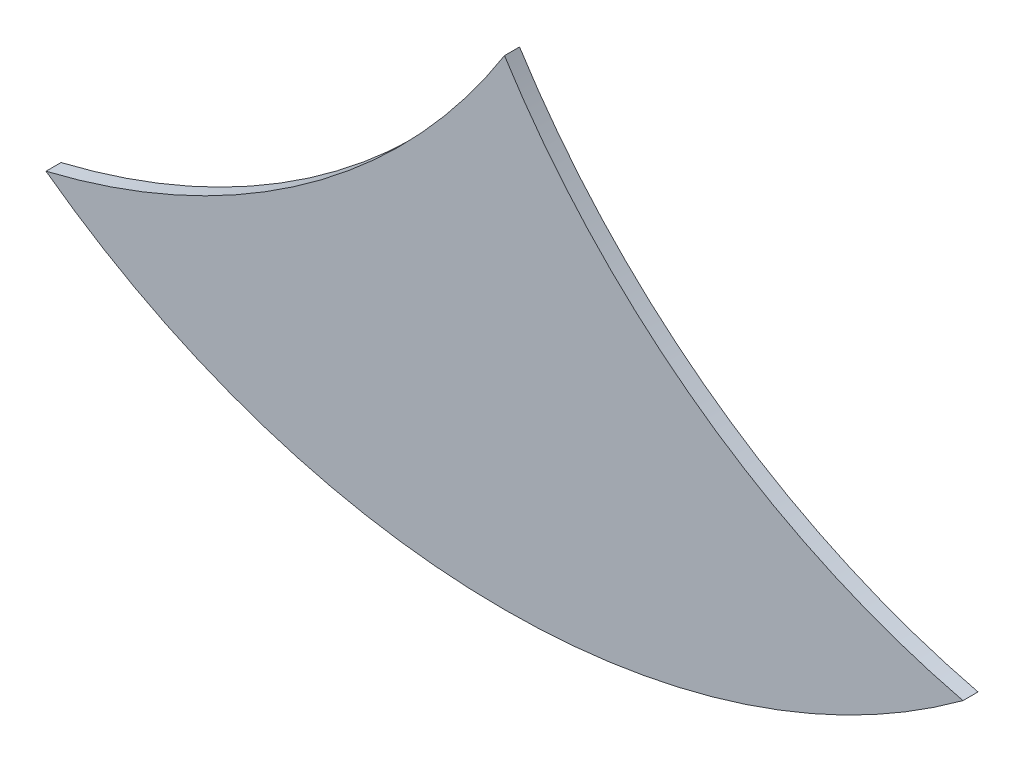
ISO-10303-21;
HEADER;
FILE_DESCRIPTION(('STEP AP214'),'2;1');
FILE_NAME('part.step','',(''),(''),'','','');
FILE_SCHEMA(('AUTOMOTIVE_DESIGN { 1 0 10303 214 1 1 1 1 }'));
ENDSEC;
DATA;
#1=APPLICATION_CONTEXT('core data for automotive mechanical design processes');
#2=APPLICATION_PROTOCOL_DEFINITION('international standard','automotive_design',2000,#1);
#3=PRODUCT_CONTEXT('',#1,'mechanical');
#4=PRODUCT('Part','Part','',(#3));
#5=PRODUCT_RELATED_PRODUCT_CATEGORY('part','',(#4));
#6=PRODUCT_DEFINITION_FORMATION('','',#4);
#7=PRODUCT_DEFINITION_CONTEXT('part definition',#1,'design');
#8=PRODUCT_DEFINITION('design','',#6,#7);
#9=PRODUCT_DEFINITION_SHAPE('','',#8);
#10=(LENGTH_UNIT() NAMED_UNIT(*) SI_UNIT(.MILLI.,.METRE.));
#11=(NAMED_UNIT(*) PLANE_ANGLE_UNIT() SI_UNIT($,.RADIAN.));
#12=(NAMED_UNIT(*) SI_UNIT($,.STERADIAN.) SOLID_ANGLE_UNIT());
#13=UNCERTAINTY_MEASURE_WITH_UNIT(LENGTH_MEASURE(1.E-05),#10,'distance_accuracy_value','');
#14=(GEOMETRIC_REPRESENTATION_CONTEXT(3) GLOBAL_UNCERTAINTY_ASSIGNED_CONTEXT((#13)) GLOBAL_UNIT_ASSIGNED_CONTEXT((#10,
#11,#12)) REPRESENTATION_CONTEXT('',''));
#15=CARTESIAN_POINT('',(0.,0.,0.));
#16=DIRECTION('',(0.,0.,1.));
#17=DIRECTION('',(1.,0.,0.));
#18=AXIS2_PLACEMENT_3D('',#15,#16,#17);
#19=CARTESIAN_POINT('',(30.351870026325,22.9673161893469,0.1));
#20=DIRECTION('',(0.,0.,-1.));
#21=DIRECTION('',(-1.,0.,0.));
#22=AXIS2_PLACEMENT_3D('',#19,#20,#21);
#23=CYLINDRICAL_SURFACE('',#22,4.99437516975804);
#24=CARTESIAN_POINT('',(30.351870026325,22.9673161893469,0.));
#25=DIRECTION('',(0.,0.,-1.));
#26=DIRECTION('',(1.,0.,0.));
#27=AXIS2_PLACEMENT_3D('',#24,#25,#26);
#28=CIRCLE('',#27,4.99437516975804);
#29=CARTESIAN_POINT('',(34.576,20.3026381033868,0.));
#30=VERTEX_POINT('',#29);
#31=CARTESIAN_POINT('',(31.5287385724846,18.1135790970276,0.));
#32=VERTEX_POINT('',#31);
#33=EDGE_CURVE('E80',#30,#32,#28,.T.);
#34=ORIENTED_EDGE('',*,*,#33,.T.);
#35=DIRECTION('',(0.,0.,-1.));
#36=VECTOR('',#35,1.);
#37=CARTESIAN_POINT('',(31.5287385724846,18.1135790970276,0.1));
#38=LINE('',#37,#36);
#39=CARTESIAN_POINT('',(31.5287385724846,18.1135790970276,0.1));
#40=VERTEX_POINT('',#39);
#41=EDGE_CURVE('E11',#40,#32,#38,.T.);
#42=ORIENTED_EDGE('',*,*,#41,.F.);
#43=CARTESIAN_POINT('',(30.351870026325,22.9673161893469,0.1));
#44=DIRECTION('',(0.,0.,-1.));
#45=DIRECTION('',(1.,0.,0.));
#46=AXIS2_PLACEMENT_3D('',#43,#44,#45);
#47=CIRCLE('',#46,4.99437516975804);
#48=CARTESIAN_POINT('',(34.576,20.3026381033868,0.1));
#49=VERTEX_POINT('',#48);
#50=EDGE_CURVE('E73',#49,#40,#47,.T.);
#51=ORIENTED_EDGE('',*,*,#50,.F.);
#52=DIRECTION('',(0.,0.,-1.));
#53=VECTOR('',#52,1.);
#54=CARTESIAN_POINT('',(34.576,20.3026381033868,0.1));
#55=LINE('',#54,#53);
#56=EDGE_CURVE('E81',#49,#30,#55,.T.);
#57=ORIENTED_EDGE('',*,*,#56,.T.);
#58=EDGE_LOOP('',(#34,#42,#51,#57));
#59=FACE_BOUND('',#58,.T.);
#60=ADVANCED_FACE('F33',(#59),#23,.F.);
#61=CARTESIAN_POINT('',(34.576,22.255363379574,0.1));
#62=DIRECTION('',(0.,0.,-1.));
#63=DIRECTION('',(-1.,0.,0.));
#64=AXIS2_PLACEMENT_3D('',#61,#62,#63);
#65=CYLINDRICAL_SURFACE('',#64,5.14200148296085);
#66=CARTESIAN_POINT('',(34.576,22.255363379574,0.));
#67=DIRECTION('',(0.,0.,1.));
#68=DIRECTION('',(1.,0.,0.));
#69=AXIS2_PLACEMENT_3D('',#66,#67,#68);
#70=CIRCLE('',#69,5.14200148296085);
#71=CARTESIAN_POINT('',(37.6232614275154,18.1135790970276,0.));
#72=VERTEX_POINT('',#71);
#73=EDGE_CURVE('E61',#32,#72,#70,.T.);
#74=ORIENTED_EDGE('',*,*,#73,.T.);
#75=DIRECTION('',(0.,0.,-1.));
#76=VECTOR('',#75,1.);
#77=CARTESIAN_POINT('',(37.6232614275154,18.1135790970276,0.1));
#78=LINE('',#77,#76);
#79=CARTESIAN_POINT('',(37.6232614275154,18.1135790970276,0.1));
#80=VERTEX_POINT('',#79);
#81=EDGE_CURVE('E41',#80,#72,#78,.T.);
#82=ORIENTED_EDGE('',*,*,#81,.F.);
#83=CARTESIAN_POINT('',(34.576,22.255363379574,0.1));
#84=DIRECTION('',(0.,0.,1.));
#85=DIRECTION('',(1.,0.,0.));
#86=AXIS2_PLACEMENT_3D('',#83,#84,#85);
#87=CIRCLE('',#86,5.14200148296085);
#88=EDGE_CURVE('E69',#40,#80,#87,.T.);
#89=ORIENTED_EDGE('',*,*,#88,.F.);
#90=ORIENTED_EDGE('',*,*,#41,.T.);
#91=EDGE_LOOP('',(#74,#82,#89,#90));
#92=FACE_BOUND('',#91,.T.);
#93=ADVANCED_FACE('F70',(#92),#65,.T.);
#94=CARTESIAN_POINT('',(38.800129973675,22.9673161893469,0.1));
#95=DIRECTION('',(0.,0.,-1.));
#96=DIRECTION('',(-1.,0.,0.));
#97=AXIS2_PLACEMENT_3D('',#94,#95,#96);
#98=CYLINDRICAL_SURFACE('',#97,4.99437516975802);
#99=CARTESIAN_POINT('',(38.800129973675,22.9673161893469,0.));
#100=DIRECTION('',(0.,0.,-1.));
#101=DIRECTION('',(1.,0.,0.));
#102=AXIS2_PLACEMENT_3D('',#99,#100,#101);
#103=CIRCLE('',#102,4.99437516975802);
#104=EDGE_CURVE('E66',#72,#30,#103,.T.);
#105=ORIENTED_EDGE('',*,*,#104,.T.);
#106=ORIENTED_EDGE('',*,*,#56,.F.);
#107=CARTESIAN_POINT('',(38.800129973675,22.9673161893469,0.1));
#108=DIRECTION('',(0.,0.,-1.));
#109=DIRECTION('',(1.,0.,0.));
#110=AXIS2_PLACEMENT_3D('',#107,#108,#109);
#111=CIRCLE('',#110,4.99437516975802);
#112=EDGE_CURVE('E49',#80,#49,#111,.T.);
#113=ORIENTED_EDGE('',*,*,#112,.F.);
#114=ORIENTED_EDGE('',*,*,#81,.T.);
#115=EDGE_LOOP('',(#105,#106,#113,#114));
#116=FACE_BOUND('',#115,.T.);
#117=ADVANCED_FACE('F88',(#116),#98,.F.);
#118=CARTESIAN_POINT('',(34.576,22.9673161893469,0.1));
#119=DIRECTION('',(0.,0.,1.));
#120=DIRECTION('',(1.,0.,0.));
#121=AXIS2_PLACEMENT_3D('',#118,#119,#120);
#122=PLANE('',#121);
#123=ORIENTED_EDGE('',*,*,#50,.T.);
#124=ORIENTED_EDGE('',*,*,#88,.T.);
#125=ORIENTED_EDGE('',*,*,#112,.T.);
#126=EDGE_LOOP('',(#123,#124,#125));
#127=FACE_BOUND('',#126,.T.);
#128=ADVANCED_FACE('F76',(#127),#122,.T.);
#129=CARTESIAN_POINT('',(34.576,22.9673161893469,0.));
#130=DIRECTION('',(0.,0.,1.));
#131=DIRECTION('',(1.,0.,0.));
#132=AXIS2_PLACEMENT_3D('',#129,#130,#131);
#133=PLANE('',#132);
#134=ORIENTED_EDGE('',*,*,#33,.F.);
#135=ORIENTED_EDGE('',*,*,#104,.F.);
#136=ORIENTED_EDGE('',*,*,#73,.F.);
#137=EDGE_LOOP('',(#134,#135,#136));
#138=FACE_BOUND('',#137,.T.);
#139=ADVANCED_FACE('F89',(#138),#133,.F.);
#140=CLOSED_SHELL('',(#60,#93,#117,#128,#139));
#141=MANIFOLD_SOLID_BREP('B2',#140);
#142=ADVANCED_BREP_SHAPE_REPRESENTATION('',(#18,#141),#14);
#143=SHAPE_DEFINITION_REPRESENTATION(#9,#142);
ENDSEC;
END-ISO-10303-21;
